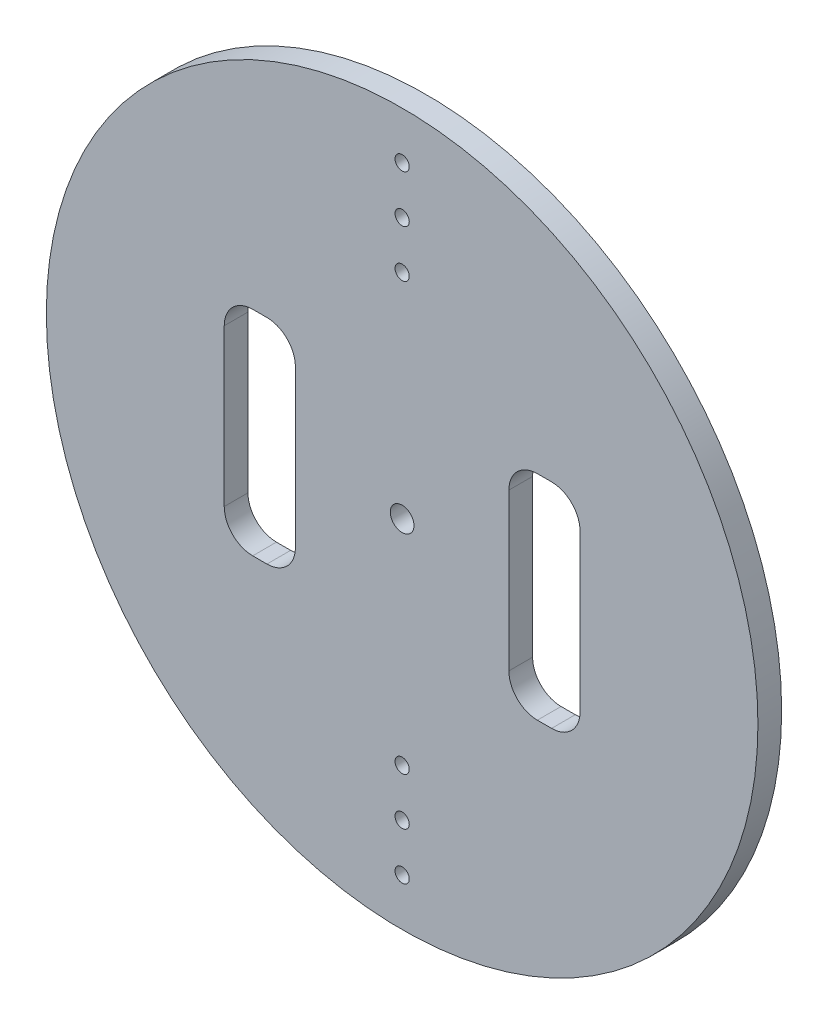
ISO-10303-21;
HEADER;
FILE_DESCRIPTION(('STEP AP214'),'2;1');
FILE_NAME('part.step','',(''),(''),'','','');
FILE_SCHEMA(('AUTOMOTIVE_DESIGN { 1 0 10303 214 1 1 1 1 }'));
ENDSEC;
DATA;
#1=APPLICATION_CONTEXT('core data for automotive mechanical design processes');
#2=APPLICATION_PROTOCOL_DEFINITION('international standard','automotive_design',2000,#1);
#3=PRODUCT_CONTEXT('',#1,'mechanical');
#4=PRODUCT('Part','Part','',(#3));
#5=PRODUCT_RELATED_PRODUCT_CATEGORY('part','',(#4));
#6=PRODUCT_DEFINITION_FORMATION('','',#4);
#7=PRODUCT_DEFINITION_CONTEXT('part definition',#1,'design');
#8=PRODUCT_DEFINITION('design','',#6,#7);
#9=PRODUCT_DEFINITION_SHAPE('','',#8);
#10=(LENGTH_UNIT() NAMED_UNIT(*) SI_UNIT(.MILLI.,.METRE.));
#11=(NAMED_UNIT(*) PLANE_ANGLE_UNIT() SI_UNIT($,.RADIAN.));
#12=(NAMED_UNIT(*) SI_UNIT($,.STERADIAN.) SOLID_ANGLE_UNIT());
#13=UNCERTAINTY_MEASURE_WITH_UNIT(LENGTH_MEASURE(1.E-05),#10,'distance_accuracy_value','');
#14=(GEOMETRIC_REPRESENTATION_CONTEXT(3) GLOBAL_UNCERTAINTY_ASSIGNED_CONTEXT((#13)) GLOBAL_UNIT_ASSIGNED_CONTEXT((#10,
#11,#12)) REPRESENTATION_CONTEXT('',''));
#15=CARTESIAN_POINT('',(0.,0.,0.));
#16=DIRECTION('',(0.,0.,1.));
#17=DIRECTION('',(1.,0.,0.));
#18=AXIS2_PLACEMENT_3D('',#15,#16,#17);
#19=CARTESIAN_POINT('',(0.,0.,5.));
#20=DIRECTION('',(0.,0.,-1.));
#21=DIRECTION('',(-1.,0.,0.));
#22=AXIS2_PLACEMENT_3D('',#19,#20,#21);
#23=CYLINDRICAL_SURFACE('',#22,75.);
#24=CARTESIAN_POINT('',(0.,0.,5.));
#25=DIRECTION('',(0.,0.,1.));
#26=DIRECTION('',(1.,0.,0.));
#27=AXIS2_PLACEMENT_3D('',#24,#25,#26);
#28=CIRCLE('',#27,75.);
#29=CARTESIAN_POINT('',(75.,0.,5.));
#30=VERTEX_POINT('',#29);
#31=EDGE_CURVE('E11',#30,#30,#28,.T.);
#32=ORIENTED_EDGE('',*,*,#31,.F.);
#33=EDGE_LOOP('',(#32));
#34=FACE_BOUND('',#33,.T.);
#35=CARTESIAN_POINT('',(0.,0.,0.));
#36=DIRECTION('',(0.,0.,1.));
#37=DIRECTION('',(1.,0.,0.));
#38=AXIS2_PLACEMENT_3D('',#35,#36,#37);
#39=CIRCLE('',#38,75.);
#40=CARTESIAN_POINT('',(75.,0.,0.));
#41=VERTEX_POINT('',#40);
#42=EDGE_CURVE('E38',#41,#41,#39,.T.);
#43=ORIENTED_EDGE('',*,*,#42,.T.);
#44=EDGE_LOOP('',(#43));
#45=FACE_BOUND('',#44,.T.);
#46=ADVANCED_FACE('F35',(#34,#45),#23,.T.);
#47=CARTESIAN_POINT('',(0.,0.,5.));
#48=DIRECTION('',(0.,0.,1.));
#49=DIRECTION('',(1.,0.,0.));
#50=AXIS2_PLACEMENT_3D('',#47,#48,#49);
#51=PLANE('',#50);
#52=CARTESIAN_POINT('',(31.5,16.5,5.));
#53=DIRECTION('',(0.,0.,-1.));
#54=DIRECTION('',(1.,0.,0.));
#55=AXIS2_PLACEMENT_3D('',#52,#53,#54);
#56=CIRCLE('',#55,6.);
#57=CARTESIAN_POINT('',(31.5,22.5,5.));
#58=VERTEX_POINT('',#57);
#59=CARTESIAN_POINT('',(37.5,16.5,5.));
#60=VERTEX_POINT('',#59);
#61=EDGE_CURVE('E149',#58,#60,#56,.T.);
#62=ORIENTED_EDGE('',*,*,#61,.T.);
#63=DIRECTION('',(0.,-1.,0.));
#64=VECTOR('',#63,1.);
#65=CARTESIAN_POINT('',(37.5,-16.5,5.));
#66=LINE('',#65,#64);
#67=CARTESIAN_POINT('',(37.5,-16.5,5.));
#68=VERTEX_POINT('',#67);
#69=EDGE_CURVE('E158',#60,#68,#66,.T.);
#70=ORIENTED_EDGE('',*,*,#69,.T.);
#71=CARTESIAN_POINT('',(31.5,-16.5,5.));
#72=DIRECTION('',(0.,0.,-1.));
#73=DIRECTION('',(1.,0.,0.));
#74=AXIS2_PLACEMENT_3D('',#71,#72,#73);
#75=CIRCLE('',#74,6.);
#76=CARTESIAN_POINT('',(31.5,-22.5,5.));
#77=VERTEX_POINT('',#76);
#78=EDGE_CURVE('E49',#68,#77,#75,.T.);
#79=ORIENTED_EDGE('',*,*,#78,.T.);
#80=DIRECTION('',(-1.,0.,0.));
#81=VECTOR('',#80,1.);
#82=CARTESIAN_POINT('',(31.5,-22.5,5.));
#83=LINE('',#82,#81);
#84=CARTESIAN_POINT('',(28.5,-22.5,5.));
#85=VERTEX_POINT('',#84);
#86=EDGE_CURVE('E173',#77,#85,#83,.T.);
#87=ORIENTED_EDGE('',*,*,#86,.T.);
#88=CARTESIAN_POINT('',(28.5,-16.5,5.));
#89=DIRECTION('',(0.,0.,-1.));
#90=DIRECTION('',(-1.,0.,0.));
#91=AXIS2_PLACEMENT_3D('',#88,#89,#90);
#92=CIRCLE('',#91,6.);
#93=CARTESIAN_POINT('',(22.5,-16.5,5.));
#94=VERTEX_POINT('',#93);
#95=EDGE_CURVE('E176',#85,#94,#92,.T.);
#96=ORIENTED_EDGE('',*,*,#95,.T.);
#97=DIRECTION('',(0.,1.,0.));
#98=VECTOR('',#97,1.);
#99=CARTESIAN_POINT('',(22.5,-16.5,5.));
#100=LINE('',#99,#98);
#101=CARTESIAN_POINT('',(22.5,16.5,5.));
#102=VERTEX_POINT('',#101);
#103=EDGE_CURVE('E179',#94,#102,#100,.T.);
#104=ORIENTED_EDGE('',*,*,#103,.T.);
#105=CARTESIAN_POINT('',(28.5,16.5,5.));
#106=DIRECTION('',(0.,0.,-1.));
#107=DIRECTION('',(1.,0.,0.));
#108=AXIS2_PLACEMENT_3D('',#105,#106,#107);
#109=CIRCLE('',#108,6.);
#110=CARTESIAN_POINT('',(28.5,22.5,5.));
#111=VERTEX_POINT('',#110);
#112=EDGE_CURVE('E182',#102,#111,#109,.T.);
#113=ORIENTED_EDGE('',*,*,#112,.T.);
#114=DIRECTION('',(1.,0.,0.));
#115=VECTOR('',#114,1.);
#116=CARTESIAN_POINT('',(31.5,22.5,5.));
#117=LINE('',#116,#115);
#118=EDGE_CURVE('E155',#111,#58,#117,.T.);
#119=ORIENTED_EDGE('',*,*,#118,.T.);
#120=EDGE_LOOP('',(#62,#70,#79,#87,#96,#104,#113,#119));
#121=FACE_BOUND('',#120,.T.);
#122=CARTESIAN_POINT('',(-31.5,-16.5,5.));
#123=DIRECTION('',(0.,0.,-1.));
#124=DIRECTION('',(-1.,0.,0.));
#125=AXIS2_PLACEMENT_3D('',#122,#123,#124);
#126=CIRCLE('',#125,6.);
#127=CARTESIAN_POINT('',(-31.5,-22.5,5.));
#128=VERTEX_POINT('',#127);
#129=CARTESIAN_POINT('',(-37.5,-16.5,5.));
#130=VERTEX_POINT('',#129);
#131=EDGE_CURVE('E216',#128,#130,#126,.T.);
#132=ORIENTED_EDGE('',*,*,#131,.T.);
#133=DIRECTION('',(0.,1.,0.));
#134=VECTOR('',#133,1.);
#135=CARTESIAN_POINT('',(-37.5,-16.5,5.));
#136=LINE('',#135,#134);
#137=CARTESIAN_POINT('',(-37.5,16.5,5.));
#138=VERTEX_POINT('',#137);
#139=EDGE_CURVE('E219',#130,#138,#136,.T.);
#140=ORIENTED_EDGE('',*,*,#139,.T.);
#141=CARTESIAN_POINT('',(-31.5,16.5,5.));
#142=DIRECTION('',(0.,0.,-1.));
#143=DIRECTION('',(1.,0.,0.));
#144=AXIS2_PLACEMENT_3D('',#141,#142,#143);
#145=CIRCLE('',#144,5.99999999999999);
#146=CARTESIAN_POINT('',(-31.5,22.5,5.));
#147=VERTEX_POINT('',#146);
#148=EDGE_CURVE('E223',#138,#147,#145,.T.);
#149=ORIENTED_EDGE('',*,*,#148,.T.);
#150=DIRECTION('',(1.,0.,0.));
#151=VECTOR('',#150,1.);
#152=CARTESIAN_POINT('',(-28.5,22.5,5.));
#153=LINE('',#152,#151);
#154=CARTESIAN_POINT('',(-28.5,22.5,5.));
#155=VERTEX_POINT('',#154);
#156=EDGE_CURVE('E226',#147,#155,#153,.T.);
#157=ORIENTED_EDGE('',*,*,#156,.T.);
#158=CARTESIAN_POINT('',(-28.5,16.5,5.));
#159=DIRECTION('',(0.,0.,-1.));
#160=DIRECTION('',(1.,0.,0.));
#161=AXIS2_PLACEMENT_3D('',#158,#159,#160);
#162=CIRCLE('',#161,6.);
#163=CARTESIAN_POINT('',(-22.5,16.5,5.));
#164=VERTEX_POINT('',#163);
#165=EDGE_CURVE('E229',#155,#164,#162,.T.);
#166=ORIENTED_EDGE('',*,*,#165,.T.);
#167=DIRECTION('',(0.,-1.,0.));
#168=VECTOR('',#167,1.);
#169=CARTESIAN_POINT('',(-22.5,-16.5,5.));
#170=LINE('',#169,#168);
#171=CARTESIAN_POINT('',(-22.5,-16.5,5.));
#172=VERTEX_POINT('',#171);
#173=EDGE_CURVE('E232',#164,#172,#170,.T.);
#174=ORIENTED_EDGE('',*,*,#173,.T.);
#175=CARTESIAN_POINT('',(-28.5,-16.5,5.));
#176=DIRECTION('',(0.,0.,-1.));
#177=DIRECTION('',(1.,0.,0.));
#178=AXIS2_PLACEMENT_3D('',#175,#176,#177);
#179=CIRCLE('',#178,6.);
#180=CARTESIAN_POINT('',(-28.5,-22.5,5.));
#181=VERTEX_POINT('',#180);
#182=EDGE_CURVE('E235',#172,#181,#179,.T.);
#183=ORIENTED_EDGE('',*,*,#182,.T.);
#184=DIRECTION('',(-1.,0.,0.));
#185=VECTOR('',#184,1.);
#186=CARTESIAN_POINT('',(-28.5,-22.5,5.));
#187=LINE('',#186,#185);
#188=EDGE_CURVE('E238',#181,#128,#187,.T.);
#189=ORIENTED_EDGE('',*,*,#188,.T.);
#190=EDGE_LOOP('',(#132,#140,#149,#157,#166,#174,#183,#189));
#191=FACE_BOUND('',#190,.T.);
#192=CARTESIAN_POINT('',(0.,-55.,5.));
#193=DIRECTION('',(0.,0.,1.));
#194=DIRECTION('',(1.,0.,0.));
#195=AXIS2_PLACEMENT_3D('',#192,#193,#194);
#196=CIRCLE('',#195,1.5);
#197=CARTESIAN_POINT('',(1.5,-55.,5.));
#198=VERTEX_POINT('',#197);
#199=EDGE_CURVE('E306',#198,#198,#196,.T.);
#200=ORIENTED_EDGE('',*,*,#199,.F.);
#201=EDGE_LOOP('',(#200));
#202=FACE_BOUND('',#201,.T.);
#203=CARTESIAN_POINT('',(0.,-65.,5.));
#204=DIRECTION('',(0.,0.,1.));
#205=DIRECTION('',(1.,0.,0.));
#206=AXIS2_PLACEMENT_3D('',#203,#204,#205);
#207=CIRCLE('',#206,1.5);
#208=CARTESIAN_POINT('',(1.5,-65.,5.));
#209=VERTEX_POINT('',#208);
#210=EDGE_CURVE('E303',#209,#209,#207,.T.);
#211=ORIENTED_EDGE('',*,*,#210,.F.);
#212=EDGE_LOOP('',(#211));
#213=FACE_BOUND('',#212,.T.);
#214=CARTESIAN_POINT('',(0.,65.,5.));
#215=DIRECTION('',(0.,0.,1.));
#216=DIRECTION('',(1.,0.,0.));
#217=AXIS2_PLACEMENT_3D('',#214,#215,#216);
#218=CIRCLE('',#217,1.5);
#219=CARTESIAN_POINT('',(1.5,65.,5.));
#220=VERTEX_POINT('',#219);
#221=EDGE_CURVE('E300',#220,#220,#218,.T.);
#222=ORIENTED_EDGE('',*,*,#221,.F.);
#223=EDGE_LOOP('',(#222));
#224=FACE_BOUND('',#223,.T.);
#225=CARTESIAN_POINT('',(0.,55.,5.));
#226=DIRECTION('',(0.,0.,1.));
#227=DIRECTION('',(1.,0.,0.));
#228=AXIS2_PLACEMENT_3D('',#225,#226,#227);
#229=CIRCLE('',#228,1.5);
#230=CARTESIAN_POINT('',(1.5,55.,5.));
#231=VERTEX_POINT('',#230);
#232=EDGE_CURVE('E297',#231,#231,#229,.T.);
#233=ORIENTED_EDGE('',*,*,#232,.F.);
#234=EDGE_LOOP('',(#233));
#235=FACE_BOUND('',#234,.T.);
#236=CARTESIAN_POINT('',(0.,45.,5.));
#237=DIRECTION('',(0.,0.,1.));
#238=DIRECTION('',(1.,0.,0.));
#239=AXIS2_PLACEMENT_3D('',#236,#237,#238);
#240=CIRCLE('',#239,1.5);
#241=CARTESIAN_POINT('',(1.5,45.,5.));
#242=VERTEX_POINT('',#241);
#243=EDGE_CURVE('E283',#242,#242,#240,.T.);
#244=ORIENTED_EDGE('',*,*,#243,.F.);
#245=EDGE_LOOP('',(#244));
#246=FACE_BOUND('',#245,.T.);
#247=CARTESIAN_POINT('',(0.,-45.,5.));
#248=DIRECTION('',(0.,0.,1.));
#249=DIRECTION('',(1.,0.,0.));
#250=AXIS2_PLACEMENT_3D('',#247,#248,#249);
#251=CIRCLE('',#250,1.5);
#252=CARTESIAN_POINT('',(1.5,-45.,5.));
#253=VERTEX_POINT('',#252);
#254=EDGE_CURVE('E312',#253,#253,#251,.T.);
#255=ORIENTED_EDGE('',*,*,#254,.F.);
#256=EDGE_LOOP('',(#255));
#257=FACE_BOUND('',#256,.T.);
#258=CARTESIAN_POINT('',(0.,0.,5.));
#259=DIRECTION('',(0.,0.,1.));
#260=DIRECTION('',(1.,0.,0.));
#261=AXIS2_PLACEMENT_3D('',#258,#259,#260);
#262=CIRCLE('',#261,2.5);
#263=CARTESIAN_POINT('',(2.5,0.,5.));
#264=VERTEX_POINT('',#263);
#265=EDGE_CURVE('E318',#264,#264,#262,.T.);
#266=ORIENTED_EDGE('',*,*,#265,.F.);
#267=EDGE_LOOP('',(#266));
#268=FACE_BOUND('',#267,.T.);
#269=ORIENTED_EDGE('',*,*,#31,.T.);
#270=EDGE_LOOP('',(#269));
#271=FACE_BOUND('',#270,.T.);
#272=ADVANCED_FACE('F162',(#121,#191,#202,#213,#224,#235,#246,#257,#268,#271),#51,.T.);
#273=CARTESIAN_POINT('',(0.,0.,0.));
#274=DIRECTION('',(0.,0.,1.));
#275=DIRECTION('',(1.,0.,0.));
#276=AXIS2_PLACEMENT_3D('',#273,#274,#275);
#277=PLANE('',#276);
#278=DIRECTION('',(0.,-1.,0.));
#279=VECTOR('',#278,1.);
#280=CARTESIAN_POINT('',(37.5,-16.5,0.));
#281=LINE('',#280,#279);
#282=CARTESIAN_POINT('',(37.5,16.5,0.));
#283=VERTEX_POINT('',#282);
#284=CARTESIAN_POINT('',(37.5,-16.5,0.));
#285=VERTEX_POINT('',#284);
#286=EDGE_CURVE('E186',#283,#285,#281,.T.);
#287=ORIENTED_EDGE('',*,*,#286,.F.);
#288=CARTESIAN_POINT('',(31.5,16.5,0.));
#289=DIRECTION('',(0.,0.,-1.));
#290=DIRECTION('',(1.,0.,0.));
#291=AXIS2_PLACEMENT_3D('',#288,#289,#290);
#292=CIRCLE('',#291,6.);
#293=CARTESIAN_POINT('',(31.5,22.5,0.));
#294=VERTEX_POINT('',#293);
#295=EDGE_CURVE('E57',#294,#283,#292,.T.);
#296=ORIENTED_EDGE('',*,*,#295,.F.);
#297=DIRECTION('',(1.,0.,0.));
#298=VECTOR('',#297,1.);
#299=CARTESIAN_POINT('',(31.5,22.5,0.));
#300=LINE('',#299,#298);
#301=CARTESIAN_POINT('',(28.5,22.5,0.));
#302=VERTEX_POINT('',#301);
#303=EDGE_CURVE('E166',#302,#294,#300,.T.);
#304=ORIENTED_EDGE('',*,*,#303,.F.);
#305=CARTESIAN_POINT('',(28.5,16.5,0.));
#306=DIRECTION('',(0.,0.,-1.));
#307=DIRECTION('',(1.,0.,0.));
#308=AXIS2_PLACEMENT_3D('',#305,#306,#307);
#309=CIRCLE('',#308,6.);
#310=CARTESIAN_POINT('',(22.5,16.5,0.));
#311=VERTEX_POINT('',#310);
#312=EDGE_CURVE('E169',#311,#302,#309,.T.);
#313=ORIENTED_EDGE('',*,*,#312,.F.);
#314=DIRECTION('',(0.,1.,0.));
#315=VECTOR('',#314,1.);
#316=CARTESIAN_POINT('',(22.5,-16.5,0.));
#317=LINE('',#316,#315);
#318=CARTESIAN_POINT('',(22.5,-16.5,0.));
#319=VERTEX_POINT('',#318);
#320=EDGE_CURVE('E197',#319,#311,#317,.T.);
#321=ORIENTED_EDGE('',*,*,#320,.F.);
#322=CARTESIAN_POINT('',(28.5,-16.5,0.));
#323=DIRECTION('',(0.,0.,-1.));
#324=DIRECTION('',(-1.,0.,0.));
#325=AXIS2_PLACEMENT_3D('',#322,#323,#324);
#326=CIRCLE('',#325,6.);
#327=CARTESIAN_POINT('',(28.5,-22.5,0.));
#328=VERTEX_POINT('',#327);
#329=EDGE_CURVE('E194',#328,#319,#326,.T.);
#330=ORIENTED_EDGE('',*,*,#329,.F.);
#331=DIRECTION('',(-1.,0.,0.));
#332=VECTOR('',#331,1.);
#333=CARTESIAN_POINT('',(31.5,-22.5,0.));
#334=LINE('',#333,#332);
#335=CARTESIAN_POINT('',(31.5,-22.5,0.));
#336=VERTEX_POINT('',#335);
#337=EDGE_CURVE('E191',#336,#328,#334,.T.);
#338=ORIENTED_EDGE('',*,*,#337,.F.);
#339=CARTESIAN_POINT('',(31.5,-16.5,0.));
#340=DIRECTION('',(0.,0.,-1.));
#341=DIRECTION('',(1.,0.,0.));
#342=AXIS2_PLACEMENT_3D('',#339,#340,#341);
#343=CIRCLE('',#342,6.);
#344=EDGE_CURVE('E188',#285,#336,#343,.T.);
#345=ORIENTED_EDGE('',*,*,#344,.F.);
#346=EDGE_LOOP('',(#287,#296,#304,#313,#321,#330,#338,#345));
#347=FACE_BOUND('',#346,.T.);
#348=DIRECTION('',(0.,1.,0.));
#349=VECTOR('',#348,1.);
#350=CARTESIAN_POINT('',(-37.5,-16.5,0.));
#351=LINE('',#350,#349);
#352=CARTESIAN_POINT('',(-37.5,-16.5,0.));
#353=VERTEX_POINT('',#352);
#354=CARTESIAN_POINT('',(-37.5,16.5,0.));
#355=VERTEX_POINT('',#354);
#356=EDGE_CURVE('E243',#353,#355,#351,.T.);
#357=ORIENTED_EDGE('',*,*,#356,.F.);
#358=CARTESIAN_POINT('',(-31.5,-16.5,0.));
#359=DIRECTION('',(0.,0.,-1.));
#360=DIRECTION('',(-1.,0.,0.));
#361=AXIS2_PLACEMENT_3D('',#358,#359,#360);
#362=CIRCLE('',#361,6.);
#363=CARTESIAN_POINT('',(-31.5,-22.5,0.));
#364=VERTEX_POINT('',#363);
#365=EDGE_CURVE('E204',#364,#353,#362,.T.);
#366=ORIENTED_EDGE('',*,*,#365,.F.);
#367=DIRECTION('',(-1.,0.,0.));
#368=VECTOR('',#367,1.);
#369=CARTESIAN_POINT('',(-28.5,-22.5,0.));
#370=LINE('',#369,#368);
#371=CARTESIAN_POINT('',(-28.5,-22.5,0.));
#372=VERTEX_POINT('',#371);
#373=EDGE_CURVE('E220',#372,#364,#370,.T.);
#374=ORIENTED_EDGE('',*,*,#373,.F.);
#375=CARTESIAN_POINT('',(-28.5,-16.5,0.));
#376=DIRECTION('',(0.,0.,-1.));
#377=DIRECTION('',(1.,0.,0.));
#378=AXIS2_PLACEMENT_3D('',#375,#376,#377);
#379=CIRCLE('',#378,6.);
#380=CARTESIAN_POINT('',(-22.5,-16.5,0.));
#381=VERTEX_POINT('',#380);
#382=EDGE_CURVE('E258',#381,#372,#379,.T.);
#383=ORIENTED_EDGE('',*,*,#382,.F.);
#384=DIRECTION('',(0.,-1.,0.));
#385=VECTOR('',#384,1.);
#386=CARTESIAN_POINT('',(-22.5,-16.5,0.));
#387=LINE('',#386,#385);
#388=CARTESIAN_POINT('',(-22.5,16.5,0.));
#389=VERTEX_POINT('',#388);
#390=EDGE_CURVE('E255',#389,#381,#387,.T.);
#391=ORIENTED_EDGE('',*,*,#390,.F.);
#392=CARTESIAN_POINT('',(-28.5,16.5,0.));
#393=DIRECTION('',(0.,0.,-1.));
#394=DIRECTION('',(1.,0.,0.));
#395=AXIS2_PLACEMENT_3D('',#392,#393,#394);
#396=CIRCLE('',#395,6.);
#397=CARTESIAN_POINT('',(-28.5,22.5,0.));
#398=VERTEX_POINT('',#397);
#399=EDGE_CURVE('E252',#398,#389,#396,.T.);
#400=ORIENTED_EDGE('',*,*,#399,.F.);
#401=DIRECTION('',(1.,0.,0.));
#402=VECTOR('',#401,1.);
#403=CARTESIAN_POINT('',(-28.5,22.5,0.));
#404=LINE('',#403,#402);
#405=CARTESIAN_POINT('',(-31.5,22.5,0.));
#406=VERTEX_POINT('',#405);
#407=EDGE_CURVE('E249',#406,#398,#404,.T.);
#408=ORIENTED_EDGE('',*,*,#407,.F.);
#409=CARTESIAN_POINT('',(-31.5,16.5,0.));
#410=DIRECTION('',(0.,0.,-1.));
#411=DIRECTION('',(1.,0.,0.));
#412=AXIS2_PLACEMENT_3D('',#409,#410,#411);
#413=CIRCLE('',#412,5.99999999999999);
#414=EDGE_CURVE('E246',#355,#406,#413,.T.);
#415=ORIENTED_EDGE('',*,*,#414,.F.);
#416=EDGE_LOOP('',(#357,#366,#374,#383,#391,#400,#408,#415));
#417=FACE_BOUND('',#416,.T.);
#418=CARTESIAN_POINT('',(0.,-55.,0.));
#419=DIRECTION('',(0.,0.,-1.));
#420=DIRECTION('',(-1.,0.,0.));
#421=AXIS2_PLACEMENT_3D('',#418,#419,#420);
#422=CIRCLE('',#421,1.5);
#423=CARTESIAN_POINT('',(-1.5,-55.,0.));
#424=VERTEX_POINT('',#423);
#425=EDGE_CURVE('E280',#424,#424,#422,.T.);
#426=ORIENTED_EDGE('',*,*,#425,.F.);
#427=EDGE_LOOP('',(#426));
#428=FACE_BOUND('',#427,.T.);
#429=CARTESIAN_POINT('',(0.,-65.,0.));
#430=DIRECTION('',(0.,0.,-1.));
#431=DIRECTION('',(-1.,0.,0.));
#432=AXIS2_PLACEMENT_3D('',#429,#430,#431);
#433=CIRCLE('',#432,1.5);
#434=CARTESIAN_POINT('',(-1.5,-65.,0.));
#435=VERTEX_POINT('',#434);
#436=EDGE_CURVE('E284',#435,#435,#433,.T.);
#437=ORIENTED_EDGE('',*,*,#436,.F.);
#438=EDGE_LOOP('',(#437));
#439=FACE_BOUND('',#438,.T.);
#440=CARTESIAN_POINT('',(0.,65.,0.));
#441=DIRECTION('',(0.,0.,-1.));
#442=DIRECTION('',(1.,0.,0.));
#443=AXIS2_PLACEMENT_3D('',#440,#441,#442);
#444=CIRCLE('',#443,1.5);
#445=CARTESIAN_POINT('',(1.5,65.,0.));
#446=VERTEX_POINT('',#445);
#447=EDGE_CURVE('E287',#446,#446,#444,.T.);
#448=ORIENTED_EDGE('',*,*,#447,.F.);
#449=EDGE_LOOP('',(#448));
#450=FACE_BOUND('',#449,.T.);
#451=CARTESIAN_POINT('',(0.,55.,0.));
#452=DIRECTION('',(0.,0.,-1.));
#453=DIRECTION('',(1.,0.,0.));
#454=AXIS2_PLACEMENT_3D('',#451,#452,#453);
#455=CIRCLE('',#454,1.5);
#456=CARTESIAN_POINT('',(1.5,55.,0.));
#457=VERTEX_POINT('',#456);
#458=EDGE_CURVE('E290',#457,#457,#455,.T.);
#459=ORIENTED_EDGE('',*,*,#458,.F.);
#460=EDGE_LOOP('',(#459));
#461=FACE_BOUND('',#460,.T.);
#462=CARTESIAN_POINT('',(0.,45.,0.));
#463=DIRECTION('',(0.,0.,-1.));
#464=DIRECTION('',(1.,0.,0.));
#465=AXIS2_PLACEMENT_3D('',#462,#463,#464);
#466=CIRCLE('',#465,1.5);
#467=CARTESIAN_POINT('',(1.5,45.,0.));
#468=VERTEX_POINT('',#467);
#469=EDGE_CURVE('E265',#468,#468,#466,.T.);
#470=ORIENTED_EDGE('',*,*,#469,.F.);
#471=EDGE_LOOP('',(#470));
#472=FACE_BOUND('',#471,.T.);
#473=CARTESIAN_POINT('',(0.,-45.,0.));
#474=DIRECTION('',(0.,0.,-1.));
#475=DIRECTION('',(-1.,0.,0.));
#476=AXIS2_PLACEMENT_3D('',#473,#474,#475);
#477=CIRCLE('',#476,1.5);
#478=CARTESIAN_POINT('',(-1.5,-45.,0.));
#479=VERTEX_POINT('',#478);
#480=EDGE_CURVE('E309',#479,#479,#477,.T.);
#481=ORIENTED_EDGE('',*,*,#480,.F.);
#482=EDGE_LOOP('',(#481));
#483=FACE_BOUND('',#482,.T.);
#484=CARTESIAN_POINT('',(0.,0.,0.));
#485=DIRECTION('',(0.,0.,-1.));
#486=DIRECTION('',(-1.,0.,0.));
#487=AXIS2_PLACEMENT_3D('',#484,#485,#486);
#488=CIRCLE('',#487,2.5);
#489=CARTESIAN_POINT('',(-2.5,0.,0.));
#490=VERTEX_POINT('',#489);
#491=EDGE_CURVE('E315',#490,#490,#488,.T.);
#492=ORIENTED_EDGE('',*,*,#491,.F.);
#493=EDGE_LOOP('',(#492));
#494=FACE_BOUND('',#493,.T.);
#495=ORIENTED_EDGE('',*,*,#42,.F.);
#496=EDGE_LOOP('',(#495));
#497=FACE_BOUND('',#496,.T.);
#498=ADVANCED_FACE('F326',(#347,#417,#428,#439,#450,#461,#472,#483,#494,#497),#277,.F.);
#499=CARTESIAN_POINT('',(0.,0.,10.));
#500=DIRECTION('',(0.,0.,-1.));
#501=DIRECTION('',(-1.,0.,0.));
#502=AXIS2_PLACEMENT_3D('',#499,#500,#501);
#503=CYLINDRICAL_SURFACE('',#502,2.5);
#504=ORIENTED_EDGE('',*,*,#265,.T.);
#505=EDGE_LOOP('',(#504));
#506=FACE_BOUND('',#505,.T.);
#507=ORIENTED_EDGE('',*,*,#491,.T.);
#508=EDGE_LOOP('',(#507));
#509=FACE_BOUND('',#508,.T.);
#510=ADVANCED_FACE('F328',(#506,#509),#503,.F.);
#511=CARTESIAN_POINT('',(0.,-45.,10.));
#512=DIRECTION('',(0.,0.,-1.));
#513=DIRECTION('',(-1.,0.,0.));
#514=AXIS2_PLACEMENT_3D('',#511,#512,#513);
#515=CYLINDRICAL_SURFACE('',#514,1.5);
#516=ORIENTED_EDGE('',*,*,#254,.T.);
#517=EDGE_LOOP('',(#516));
#518=FACE_BOUND('',#517,.T.);
#519=ORIENTED_EDGE('',*,*,#480,.T.);
#520=EDGE_LOOP('',(#519));
#521=FACE_BOUND('',#520,.T.);
#522=ADVANCED_FACE('F334',(#518,#521),#515,.F.);
#523=CARTESIAN_POINT('',(0.,45.,10.));
#524=DIRECTION('',(0.,0.,-1.));
#525=DIRECTION('',(-1.,0.,0.));
#526=AXIS2_PLACEMENT_3D('',#523,#524,#525);
#527=CYLINDRICAL_SURFACE('',#526,1.5);
#528=ORIENTED_EDGE('',*,*,#243,.T.);
#529=EDGE_LOOP('',(#528));
#530=FACE_BOUND('',#529,.T.);
#531=ORIENTED_EDGE('',*,*,#469,.T.);
#532=EDGE_LOOP('',(#531));
#533=FACE_BOUND('',#532,.T.);
#534=ADVANCED_FACE('F533',(#530,#533),#527,.F.);
#535=CARTESIAN_POINT('',(0.,55.,10.));
#536=DIRECTION('',(0.,0.,-1.));
#537=DIRECTION('',(-1.,0.,0.));
#538=AXIS2_PLACEMENT_3D('',#535,#536,#537);
#539=CYLINDRICAL_SURFACE('',#538,1.5);
#540=ORIENTED_EDGE('',*,*,#232,.T.);
#541=EDGE_LOOP('',(#540));
#542=FACE_BOUND('',#541,.T.);
#543=ORIENTED_EDGE('',*,*,#458,.T.);
#544=EDGE_LOOP('',(#543));
#545=FACE_BOUND('',#544,.T.);
#546=ADVANCED_FACE('F529',(#542,#545),#539,.F.);
#547=CARTESIAN_POINT('',(0.,65.,10.));
#548=DIRECTION('',(0.,0.,-1.));
#549=DIRECTION('',(-1.,0.,0.));
#550=AXIS2_PLACEMENT_3D('',#547,#548,#549);
#551=CYLINDRICAL_SURFACE('',#550,1.5);
#552=ORIENTED_EDGE('',*,*,#221,.T.);
#553=EDGE_LOOP('',(#552));
#554=FACE_BOUND('',#553,.T.);
#555=ORIENTED_EDGE('',*,*,#447,.T.);
#556=EDGE_LOOP('',(#555));
#557=FACE_BOUND('',#556,.T.);
#558=ADVANCED_FACE('F525',(#554,#557),#551,.F.);
#559=CARTESIAN_POINT('',(0.,-65.,10.));
#560=DIRECTION('',(0.,0.,-1.));
#561=DIRECTION('',(-1.,0.,0.));
#562=AXIS2_PLACEMENT_3D('',#559,#560,#561);
#563=CYLINDRICAL_SURFACE('',#562,1.5);
#564=ORIENTED_EDGE('',*,*,#210,.T.);
#565=EDGE_LOOP('',(#564));
#566=FACE_BOUND('',#565,.T.);
#567=ORIENTED_EDGE('',*,*,#436,.T.);
#568=EDGE_LOOP('',(#567));
#569=FACE_BOUND('',#568,.T.);
#570=ADVANCED_FACE('F521',(#566,#569),#563,.F.);
#571=CARTESIAN_POINT('',(0.,-55.,10.));
#572=DIRECTION('',(0.,0.,-1.));
#573=DIRECTION('',(-1.,0.,0.));
#574=AXIS2_PLACEMENT_3D('',#571,#572,#573);
#575=CYLINDRICAL_SURFACE('',#574,1.5);
#576=ORIENTED_EDGE('',*,*,#199,.T.);
#577=EDGE_LOOP('',(#576));
#578=FACE_BOUND('',#577,.T.);
#579=ORIENTED_EDGE('',*,*,#425,.T.);
#580=EDGE_LOOP('',(#579));
#581=FACE_BOUND('',#580,.T.);
#582=ADVANCED_FACE('F355',(#578,#581),#575,.F.);
#583=CARTESIAN_POINT('',(-31.5,-16.5,5.));
#584=DIRECTION('',(0.,0.,-1.));
#585=DIRECTION('',(-1.,0.,0.));
#586=AXIS2_PLACEMENT_3D('',#583,#584,#585);
#587=CYLINDRICAL_SURFACE('',#586,6.);
#588=ORIENTED_EDGE('',*,*,#365,.T.);
#589=DIRECTION('',(0.,0.,-1.));
#590=VECTOR('',#589,1.);
#591=CARTESIAN_POINT('',(-37.5,-16.5,5.));
#592=LINE('',#591,#590);
#593=EDGE_CURVE('E241',#130,#353,#592,.T.);
#594=ORIENTED_EDGE('',*,*,#593,.F.);
#595=ORIENTED_EDGE('',*,*,#131,.F.);
#596=DIRECTION('',(0.,0.,-1.));
#597=VECTOR('',#596,1.);
#598=CARTESIAN_POINT('',(-31.5,-22.5,5.));
#599=LINE('',#598,#597);
#600=EDGE_CURVE('E263',#128,#364,#599,.T.);
#601=ORIENTED_EDGE('',*,*,#600,.T.);
#602=EDGE_LOOP('',(#588,#594,#595,#601));
#603=FACE_BOUND('',#602,.T.);
#604=ADVANCED_FACE('F365',(#603),#587,.F.);
#605=CARTESIAN_POINT('',(-28.5,-22.5,5.));
#606=DIRECTION('',(0.,-1.,0.));
#607=DIRECTION('',(0.,0.,-1.));
#608=AXIS2_PLACEMENT_3D('',#605,#606,#607);
#609=PLANE('',#608);
#610=ORIENTED_EDGE('',*,*,#373,.T.);
#611=ORIENTED_EDGE('',*,*,#600,.F.);
#612=ORIENTED_EDGE('',*,*,#188,.F.);
#613=DIRECTION('',(0.,0.,-1.));
#614=VECTOR('',#613,1.);
#615=CARTESIAN_POINT('',(-28.5,-22.5,5.));
#616=LINE('',#615,#614);
#617=EDGE_CURVE('E266',#181,#372,#616,.T.);
#618=ORIENTED_EDGE('',*,*,#617,.T.);
#619=EDGE_LOOP('',(#610,#611,#612,#618));
#620=FACE_BOUND('',#619,.T.);
#621=ADVANCED_FACE('F370',(#620),#609,.F.);
#622=CARTESIAN_POINT('',(-28.5,-16.5,5.));
#623=DIRECTION('',(0.,0.,-1.));
#624=DIRECTION('',(-1.,0.,0.));
#625=AXIS2_PLACEMENT_3D('',#622,#623,#624);
#626=CYLINDRICAL_SURFACE('',#625,6.);
#627=ORIENTED_EDGE('',*,*,#382,.T.);
#628=ORIENTED_EDGE('',*,*,#617,.F.);
#629=ORIENTED_EDGE('',*,*,#182,.F.);
#630=DIRECTION('',(0.,0.,-1.));
#631=VECTOR('',#630,1.);
#632=CARTESIAN_POINT('',(-22.5,-16.5,5.));
#633=LINE('',#632,#631);
#634=EDGE_CURVE('E268',#172,#381,#633,.T.);
#635=ORIENTED_EDGE('',*,*,#634,.T.);
#636=EDGE_LOOP('',(#627,#628,#629,#635));
#637=FACE_BOUND('',#636,.T.);
#638=ADVANCED_FACE('F380',(#637),#626,.F.);
#639=CARTESIAN_POINT('',(-22.5,-16.5,5.));
#640=DIRECTION('',(1.,0.,0.));
#641=DIRECTION('',(0.,0.,-1.));
#642=AXIS2_PLACEMENT_3D('',#639,#640,#641);
#643=PLANE('',#642);
#644=ORIENTED_EDGE('',*,*,#390,.T.);
#645=ORIENTED_EDGE('',*,*,#634,.F.);
#646=ORIENTED_EDGE('',*,*,#173,.F.);
#647=DIRECTION('',(0.,0.,-1.));
#648=VECTOR('',#647,1.);
#649=CARTESIAN_POINT('',(-22.5,16.5,5.));
#650=LINE('',#649,#648);
#651=EDGE_CURVE('E270',#164,#389,#650,.T.);
#652=ORIENTED_EDGE('',*,*,#651,.T.);
#653=EDGE_LOOP('',(#644,#645,#646,#652));
#654=FACE_BOUND('',#653,.T.);
#655=ADVANCED_FACE('F390',(#654),#643,.F.);
#656=CARTESIAN_POINT('',(-28.5,16.5,5.));
#657=DIRECTION('',(0.,0.,-1.));
#658=DIRECTION('',(-1.,0.,0.));
#659=AXIS2_PLACEMENT_3D('',#656,#657,#658);
#660=CYLINDRICAL_SURFACE('',#659,6.);
#661=ORIENTED_EDGE('',*,*,#399,.T.);
#662=ORIENTED_EDGE('',*,*,#651,.F.);
#663=ORIENTED_EDGE('',*,*,#165,.F.);
#664=DIRECTION('',(0.,0.,-1.));
#665=VECTOR('',#664,1.);
#666=CARTESIAN_POINT('',(-28.5,22.5,5.));
#667=LINE('',#666,#665);
#668=EDGE_CURVE('E272',#155,#398,#667,.T.);
#669=ORIENTED_EDGE('',*,*,#668,.T.);
#670=EDGE_LOOP('',(#661,#662,#663,#669));
#671=FACE_BOUND('',#670,.T.);
#672=ADVANCED_FACE('F400',(#671),#660,.F.);
#673=CARTESIAN_POINT('',(-28.5,22.5,5.));
#674=DIRECTION('',(0.,1.,0.));
#675=DIRECTION('',(0.,0.,1.));
#676=AXIS2_PLACEMENT_3D('',#673,#674,#675);
#677=PLANE('',#676);
#678=ORIENTED_EDGE('',*,*,#407,.T.);
#679=ORIENTED_EDGE('',*,*,#668,.F.);
#680=ORIENTED_EDGE('',*,*,#156,.F.);
#681=DIRECTION('',(0.,0.,-1.));
#682=VECTOR('',#681,1.);
#683=CARTESIAN_POINT('',(-31.5,22.5,5.));
#684=LINE('',#683,#682);
#685=EDGE_CURVE('E274',#147,#406,#684,.T.);
#686=ORIENTED_EDGE('',*,*,#685,.T.);
#687=EDGE_LOOP('',(#678,#679,#680,#686));
#688=FACE_BOUND('',#687,.T.);
#689=ADVANCED_FACE('F410',(#688),#677,.F.);
#690=CARTESIAN_POINT('',(-31.5,16.5,5.));
#691=DIRECTION('',(0.,0.,-1.));
#692=DIRECTION('',(-1.,0.,0.));
#693=AXIS2_PLACEMENT_3D('',#690,#691,#692);
#694=CYLINDRICAL_SURFACE('',#693,5.99999999999999);
#695=ORIENTED_EDGE('',*,*,#414,.T.);
#696=ORIENTED_EDGE('',*,*,#685,.F.);
#697=ORIENTED_EDGE('',*,*,#148,.F.);
#698=DIRECTION('',(0.,0.,-1.));
#699=VECTOR('',#698,1.);
#700=CARTESIAN_POINT('',(-37.5,16.5,5.));
#701=LINE('',#700,#699);
#702=EDGE_CURVE('E276',#138,#355,#701,.T.);
#703=ORIENTED_EDGE('',*,*,#702,.T.);
#704=EDGE_LOOP('',(#695,#696,#697,#703));
#705=FACE_BOUND('',#704,.T.);
#706=ADVANCED_FACE('F420',(#705),#694,.F.);
#707=CARTESIAN_POINT('',(-37.5,-16.5,5.));
#708=DIRECTION('',(-1.,0.,0.));
#709=DIRECTION('',(0.,-1.,0.));
#710=AXIS2_PLACEMENT_3D('',#707,#708,#709);
#711=PLANE('',#710);
#712=ORIENTED_EDGE('',*,*,#356,.T.);
#713=ORIENTED_EDGE('',*,*,#702,.F.);
#714=ORIENTED_EDGE('',*,*,#139,.F.);
#715=ORIENTED_EDGE('',*,*,#593,.T.);
#716=EDGE_LOOP('',(#712,#713,#714,#715));
#717=FACE_BOUND('',#716,.T.);
#718=ADVANCED_FACE('F430',(#717),#711,.F.);
#719=CARTESIAN_POINT('',(31.5,16.5,5.));
#720=DIRECTION('',(0.,0.,-1.));
#721=DIRECTION('',(-1.,0.,0.));
#722=AXIS2_PLACEMENT_3D('',#719,#720,#721);
#723=CYLINDRICAL_SURFACE('',#722,6.);
#724=ORIENTED_EDGE('',*,*,#295,.T.);
#725=DIRECTION('',(0.,0.,-1.));
#726=VECTOR('',#725,1.);
#727=CARTESIAN_POINT('',(37.5,16.5,5.));
#728=LINE('',#727,#726);
#729=EDGE_CURVE('E145',#60,#283,#728,.T.);
#730=ORIENTED_EDGE('',*,*,#729,.F.);
#731=ORIENTED_EDGE('',*,*,#61,.F.);
#732=DIRECTION('',(0.,0.,-1.));
#733=VECTOR('',#732,1.);
#734=CARTESIAN_POINT('',(31.5,22.5,5.));
#735=LINE('',#734,#733);
#736=EDGE_CURVE('E202',#58,#294,#735,.T.);
#737=ORIENTED_EDGE('',*,*,#736,.T.);
#738=EDGE_LOOP('',(#724,#730,#731,#737));
#739=FACE_BOUND('',#738,.T.);
#740=ADVANCED_FACE('F147',(#739),#723,.F.);
#741=CARTESIAN_POINT('',(31.5,22.5,5.));
#742=DIRECTION('',(0.,1.,0.));
#743=DIRECTION('',(0.,0.,1.));
#744=AXIS2_PLACEMENT_3D('',#741,#742,#743);
#745=PLANE('',#744);
#746=ORIENTED_EDGE('',*,*,#303,.T.);
#747=ORIENTED_EDGE('',*,*,#736,.F.);
#748=ORIENTED_EDGE('',*,*,#118,.F.);
#749=DIRECTION('',(0.,0.,-1.));
#750=VECTOR('',#749,1.);
#751=CARTESIAN_POINT('',(28.5,22.5,5.));
#752=LINE('',#751,#750);
#753=EDGE_CURVE('E205',#111,#302,#752,.T.);
#754=ORIENTED_EDGE('',*,*,#753,.T.);
#755=EDGE_LOOP('',(#746,#747,#748,#754));
#756=FACE_BOUND('',#755,.T.);
#757=ADVANCED_FACE('F449',(#756),#745,.F.);
#758=CARTESIAN_POINT('',(28.5,16.5,5.));
#759=DIRECTION('',(0.,0.,-1.));
#760=DIRECTION('',(-1.,0.,0.));
#761=AXIS2_PLACEMENT_3D('',#758,#759,#760);
#762=CYLINDRICAL_SURFACE('',#761,6.);
#763=ORIENTED_EDGE('',*,*,#312,.T.);
#764=ORIENTED_EDGE('',*,*,#753,.F.);
#765=ORIENTED_EDGE('',*,*,#112,.F.);
#766=DIRECTION('',(0.,0.,-1.));
#767=VECTOR('',#766,1.);
#768=CARTESIAN_POINT('',(22.5,16.5,5.));
#769=LINE('',#768,#767);
#770=EDGE_CURVE('E207',#102,#311,#769,.T.);
#771=ORIENTED_EDGE('',*,*,#770,.T.);
#772=EDGE_LOOP('',(#763,#764,#765,#771));
#773=FACE_BOUND('',#772,.T.);
#774=ADVANCED_FACE('F458',(#773),#762,.F.);
#775=CARTESIAN_POINT('',(22.5,-16.5,5.));
#776=DIRECTION('',(-1.,0.,0.));
#777=DIRECTION('',(0.,0.,1.));
#778=AXIS2_PLACEMENT_3D('',#775,#776,#777);
#779=PLANE('',#778);
#780=ORIENTED_EDGE('',*,*,#320,.T.);
#781=ORIENTED_EDGE('',*,*,#770,.F.);
#782=ORIENTED_EDGE('',*,*,#103,.F.);
#783=DIRECTION('',(0.,0.,-1.));
#784=VECTOR('',#783,1.);
#785=CARTESIAN_POINT('',(22.5,-16.5,5.));
#786=LINE('',#785,#784);
#787=EDGE_CURVE('E209',#94,#319,#786,.T.);
#788=ORIENTED_EDGE('',*,*,#787,.T.);
#789=EDGE_LOOP('',(#780,#781,#782,#788));
#790=FACE_BOUND('',#789,.T.);
#791=ADVANCED_FACE('F468',(#790),#779,.F.);
#792=CARTESIAN_POINT('',(28.5,-16.5,5.));
#793=DIRECTION('',(0.,0.,-1.));
#794=DIRECTION('',(-1.,0.,0.));
#795=AXIS2_PLACEMENT_3D('',#792,#793,#794);
#796=CYLINDRICAL_SURFACE('',#795,6.);
#797=ORIENTED_EDGE('',*,*,#329,.T.);
#798=ORIENTED_EDGE('',*,*,#787,.F.);
#799=ORIENTED_EDGE('',*,*,#95,.F.);
#800=DIRECTION('',(0.,0.,-1.));
#801=VECTOR('',#800,1.);
#802=CARTESIAN_POINT('',(28.5,-22.5,5.));
#803=LINE('',#802,#801);
#804=EDGE_CURVE('E211',#85,#328,#803,.T.);
#805=ORIENTED_EDGE('',*,*,#804,.T.);
#806=EDGE_LOOP('',(#797,#798,#799,#805));
#807=FACE_BOUND('',#806,.T.);
#808=ADVANCED_FACE('F478',(#807),#796,.F.);
#809=CARTESIAN_POINT('',(31.5,-22.5,5.));
#810=DIRECTION('',(0.,-1.,0.));
#811=DIRECTION('',(0.,0.,-1.));
#812=AXIS2_PLACEMENT_3D('',#809,#810,#811);
#813=PLANE('',#812);
#814=ORIENTED_EDGE('',*,*,#337,.T.);
#815=ORIENTED_EDGE('',*,*,#804,.F.);
#816=ORIENTED_EDGE('',*,*,#86,.F.);
#817=DIRECTION('',(0.,0.,-1.));
#818=VECTOR('',#817,1.);
#819=CARTESIAN_POINT('',(31.5,-22.5,5.));
#820=LINE('',#819,#818);
#821=EDGE_CURVE('E213',#77,#336,#820,.T.);
#822=ORIENTED_EDGE('',*,*,#821,.T.);
#823=EDGE_LOOP('',(#814,#815,#816,#822));
#824=FACE_BOUND('',#823,.T.);
#825=ADVANCED_FACE('F488',(#824),#813,.F.);
#826=CARTESIAN_POINT('',(31.5,-16.5,5.));
#827=DIRECTION('',(0.,0.,-1.));
#828=DIRECTION('',(-1.,0.,0.));
#829=AXIS2_PLACEMENT_3D('',#826,#827,#828);
#830=CYLINDRICAL_SURFACE('',#829,6.);
#831=ORIENTED_EDGE('',*,*,#344,.T.);
#832=ORIENTED_EDGE('',*,*,#821,.F.);
#833=ORIENTED_EDGE('',*,*,#78,.F.);
#834=DIRECTION('',(0.,0.,-1.));
#835=VECTOR('',#834,1.);
#836=CARTESIAN_POINT('',(37.5,-16.5,5.));
#837=LINE('',#836,#835);
#838=EDGE_CURVE('E154',#68,#285,#837,.T.);
#839=ORIENTED_EDGE('',*,*,#838,.T.);
#840=EDGE_LOOP('',(#831,#832,#833,#839));
#841=FACE_BOUND('',#840,.T.);
#842=ADVANCED_FACE('F498',(#841),#830,.F.);
#843=CARTESIAN_POINT('',(37.5,-16.5,5.));
#844=DIRECTION('',(1.,0.,0.));
#845=DIRECTION('',(0.,0.,-1.));
#846=AXIS2_PLACEMENT_3D('',#843,#844,#845);
#847=PLANE('',#846);
#848=ORIENTED_EDGE('',*,*,#286,.T.);
#849=ORIENTED_EDGE('',*,*,#838,.F.);
#850=ORIENTED_EDGE('',*,*,#69,.F.);
#851=ORIENTED_EDGE('',*,*,#729,.T.);
#852=EDGE_LOOP('',(#848,#849,#850,#851));
#853=FACE_BOUND('',#852,.T.);
#854=ADVANCED_FACE('F159',(#853),#847,.F.);
#855=CLOSED_SHELL('',(#46,#272,#498,#510,#522,#534,#546,#558,#570,#582,#604,#621,#638,#655,#672,
#689,#706,#718,#740,#757,#774,#791,#808,#825,#842,#854));
#856=MANIFOLD_SOLID_BREP('B2',#855);
#857=ADVANCED_BREP_SHAPE_REPRESENTATION('',(#18,#856),#14);
#858=SHAPE_DEFINITION_REPRESENTATION(#9,#857);
ENDSEC;
END-ISO-10303-21;
